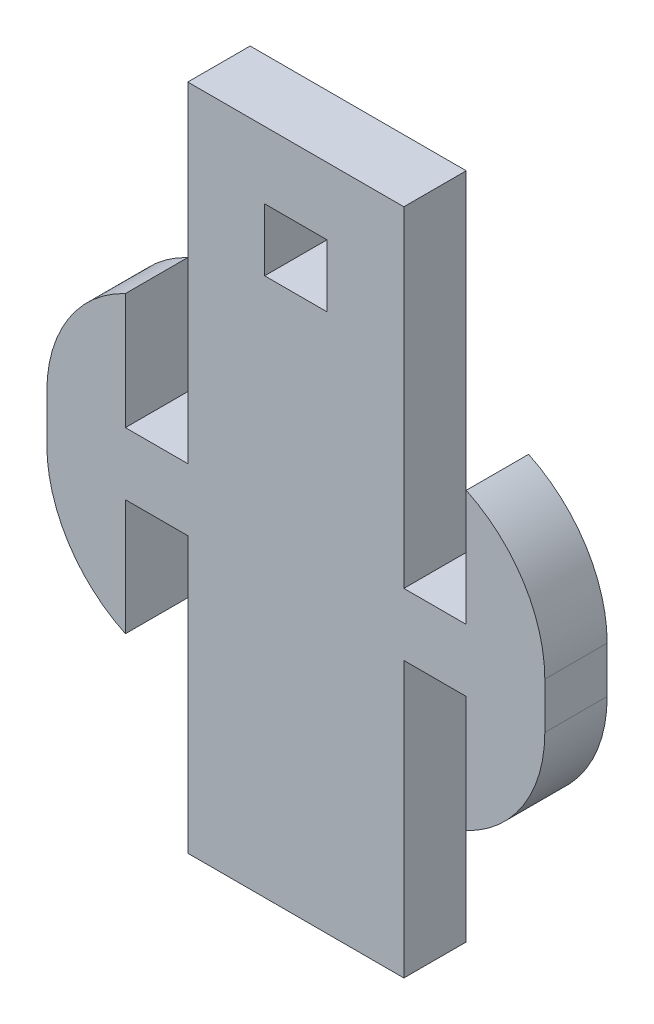
ISO-10303-21;
HEADER;
FILE_DESCRIPTION(('STEP AP214'),'2;1');
FILE_NAME('part.step','',(''),(''),'','','');
FILE_SCHEMA(('AUTOMOTIVE_DESIGN { 1 0 10303 214 1 1 1 1 }'));
ENDSEC;
DATA;
#1=APPLICATION_CONTEXT('core data for automotive mechanical design processes');
#2=APPLICATION_PROTOCOL_DEFINITION('international standard','automotive_design',2000,#1);
#3=PRODUCT_CONTEXT('',#1,'mechanical');
#4=PRODUCT('Part','Part','',(#3));
#5=PRODUCT_RELATED_PRODUCT_CATEGORY('part','',(#4));
#6=PRODUCT_DEFINITION_FORMATION('','',#4);
#7=PRODUCT_DEFINITION_CONTEXT('part definition',#1,'design');
#8=PRODUCT_DEFINITION('design','',#6,#7);
#9=PRODUCT_DEFINITION_SHAPE('','',#8);
#10=(LENGTH_UNIT() NAMED_UNIT(*) SI_UNIT(.MILLI.,.METRE.));
#11=(NAMED_UNIT(*) PLANE_ANGLE_UNIT() SI_UNIT($,.RADIAN.));
#12=(NAMED_UNIT(*) SI_UNIT($,.STERADIAN.) SOLID_ANGLE_UNIT());
#13=UNCERTAINTY_MEASURE_WITH_UNIT(LENGTH_MEASURE(1.E-05),#10,'distance_accuracy_value','');
#14=(GEOMETRIC_REPRESENTATION_CONTEXT(3) GLOBAL_UNCERTAINTY_ASSIGNED_CONTEXT((#13)) GLOBAL_UNIT_ASSIGNED_CONTEXT((#10,
#11,#12)) REPRESENTATION_CONTEXT('',''));
#15=CARTESIAN_POINT('',(0.,0.,0.));
#16=DIRECTION('',(0.,0.,1.));
#17=DIRECTION('',(1.,0.,0.));
#18=AXIS2_PLACEMENT_3D('',#15,#16,#17);
#19=CARTESIAN_POINT('',(3.,45.5623633111909,3.175));
#20=DIRECTION('',(0.,1.,0.));
#21=DIRECTION('',(0.,0.,1.));
#22=AXIS2_PLACEMENT_3D('',#19,#20,#21);
#23=PLANE('',#22);
#24=DIRECTION('',(1.,0.,0.));
#25=VECTOR('',#24,1.);
#26=CARTESIAN_POINT('',(3.,45.5623633111909,0.));
#27=LINE('',#26,#25);
#28=CARTESIAN_POINT('',(-5.5,45.5623633111909,0.));
#29=VERTEX_POINT('',#28);
#30=CARTESIAN_POINT('',(5.5,45.5623633111909,0.));
#31=VERTEX_POINT('',#30);
#32=EDGE_CURVE('E278',#29,#31,#27,.T.);
#33=ORIENTED_EDGE('',*,*,#32,.T.);
#34=DIRECTION('',(0.,0.,-1.));
#35=VECTOR('',#34,1.);
#36=CARTESIAN_POINT('',(5.5,45.5623633111909,3.175));
#37=LINE('',#36,#35);
#38=CARTESIAN_POINT('',(5.5,45.5623633111909,3.175));
#39=VERTEX_POINT('',#38);
#40=EDGE_CURVE('E355',#39,#31,#37,.T.);
#41=ORIENTED_EDGE('',*,*,#40,.F.);
#42=DIRECTION('',(1.,0.,0.));
#43=VECTOR('',#42,1.);
#44=CARTESIAN_POINT('',(-3.,45.5623633111909,3.175));
#45=LINE('',#44,#43);
#46=CARTESIAN_POINT('',(-5.5,45.5623633111909,3.175));
#47=VERTEX_POINT('',#46);
#48=EDGE_CURVE('E285',#47,#39,#45,.T.);
#49=ORIENTED_EDGE('',*,*,#48,.F.);
#50=DIRECTION('',(0.,0.,-1.));
#51=VECTOR('',#50,1.);
#52=CARTESIAN_POINT('',(-5.5,45.5623633111909,3.175));
#53=LINE('',#52,#51);
#54=EDGE_CURVE('E306',#47,#29,#53,.T.);
#55=ORIENTED_EDGE('',*,*,#54,.T.);
#56=EDGE_LOOP('',(#33,#41,#49,#55));
#57=FACE_BOUND('',#56,.T.);
#58=ADVANCED_FACE('F34',(#57),#23,.F.);
#59=CARTESIAN_POINT('',(5.5,59.5623633111909,3.175));
#60=DIRECTION('',(-1.,0.,0.));
#61=DIRECTION('',(0.,-1.,0.));
#62=AXIS2_PLACEMENT_3D('',#59,#60,#61);
#63=PLANE('',#62);
#64=DIRECTION('',(0.,1.,0.));
#65=VECTOR('',#64,1.);
#66=CARTESIAN_POINT('',(5.5,59.5623633111909,0.));
#67=LINE('',#66,#65);
#68=CARTESIAN_POINT('',(5.5,59.5623633111909,0.));
#69=VERTEX_POINT('',#68);
#70=EDGE_CURVE('E308',#31,#69,#67,.T.);
#71=ORIENTED_EDGE('',*,*,#70,.T.);
#72=DIRECTION('',(0.,0.,-1.));
#73=VECTOR('',#72,1.);
#74=CARTESIAN_POINT('',(5.5,59.5623633111909,3.175));
#75=LINE('',#74,#73);
#76=CARTESIAN_POINT('',(5.5,59.5623633111909,3.175));
#77=VERTEX_POINT('',#76);
#78=EDGE_CURVE('E352',#77,#69,#75,.T.);
#79=ORIENTED_EDGE('',*,*,#78,.F.);
#80=DIRECTION('',(0.,1.,0.));
#81=VECTOR('',#80,1.);
#82=CARTESIAN_POINT('',(5.5,59.5623633111909,3.175));
#83=LINE('',#82,#81);
#84=EDGE_CURVE('E287',#39,#77,#83,.T.);
#85=ORIENTED_EDGE('',*,*,#84,.F.);
#86=ORIENTED_EDGE('',*,*,#40,.T.);
#87=EDGE_LOOP('',(#71,#79,#85,#86));
#88=FACE_BOUND('',#87,.T.);
#89=ADVANCED_FACE('F408',(#88),#63,.F.);
#90=CARTESIAN_POINT('',(5.5,59.5623633111909,3.175));
#91=DIRECTION('',(0.,1.,0.));
#92=DIRECTION('',(0.,0.,1.));
#93=AXIS2_PLACEMENT_3D('',#90,#91,#92);
#94=PLANE('',#93);
#95=DIRECTION('',(1.,0.,0.));
#96=VECTOR('',#95,1.);
#97=CARTESIAN_POINT('',(5.5,59.5623633111909,0.));
#98=LINE('',#97,#96);
#99=CARTESIAN_POINT('',(8.675,59.5623633111909,0.));
#100=VERTEX_POINT('',#99);
#101=EDGE_CURVE('E310',#69,#100,#98,.T.);
#102=ORIENTED_EDGE('',*,*,#101,.T.);
#103=DIRECTION('',(0.,0.,-1.));
#104=VECTOR('',#103,1.);
#105=CARTESIAN_POINT('',(8.675,59.5623633111909,3.175));
#106=LINE('',#105,#104);
#107=CARTESIAN_POINT('',(8.675,59.5623633111909,3.175));
#108=VERTEX_POINT('',#107);
#109=EDGE_CURVE('E349',#108,#100,#106,.T.);
#110=ORIENTED_EDGE('',*,*,#109,.F.);
#111=DIRECTION('',(1.,0.,0.));
#112=VECTOR('',#111,1.);
#113=CARTESIAN_POINT('',(5.5,59.5623633111909,3.175));
#114=LINE('',#113,#112);
#115=EDGE_CURVE('E290',#77,#108,#114,.T.);
#116=ORIENTED_EDGE('',*,*,#115,.F.);
#117=ORIENTED_EDGE('',*,*,#78,.T.);
#118=EDGE_LOOP('',(#102,#110,#116,#117));
#119=FACE_BOUND('',#118,.T.);
#120=ADVANCED_FACE('F403',(#119),#94,.F.);
#121=CARTESIAN_POINT('',(8.675,62.7373633111909,3.175));
#122=DIRECTION('',(0.,-1.,0.));
#123=DIRECTION('',(0.,0.,-1.));
#124=AXIS2_PLACEMENT_3D('',#121,#122,#123);
#125=PLANE('',#124);
#126=DIRECTION('',(-1.,0.,0.));
#127=VECTOR('',#126,1.);
#128=CARTESIAN_POINT('',(8.675,62.7373633111909,0.));
#129=LINE('',#128,#127);
#130=CARTESIAN_POINT('',(8.675,62.7373633111909,0.));
#131=VERTEX_POINT('',#130);
#132=CARTESIAN_POINT('',(5.5,62.7373633111909,0.));
#133=VERTEX_POINT('',#132);
#134=EDGE_CURVE('E215',#131,#133,#129,.T.);
#135=ORIENTED_EDGE('',*,*,#134,.T.);
#136=DIRECTION('',(0.,0.,-1.));
#137=VECTOR('',#136,1.);
#138=CARTESIAN_POINT('',(5.5,62.7373633111909,3.175));
#139=LINE('',#138,#137);
#140=CARTESIAN_POINT('',(5.5,62.7373633111909,3.175));
#141=VERTEX_POINT('',#140);
#142=EDGE_CURVE('E344',#141,#133,#139,.T.);
#143=ORIENTED_EDGE('',*,*,#142,.F.);
#144=DIRECTION('',(-1.,0.,0.));
#145=VECTOR('',#144,1.);
#146=CARTESIAN_POINT('',(8.675,62.7373633111909,3.175));
#147=LINE('',#146,#145);
#148=CARTESIAN_POINT('',(8.675,62.7373633111909,3.175));
#149=VERTEX_POINT('',#148);
#150=EDGE_CURVE('E292',#149,#141,#147,.T.);
#151=ORIENTED_EDGE('',*,*,#150,.F.);
#152=DIRECTION('',(0.,0.,-1.));
#153=VECTOR('',#152,1.);
#154=CARTESIAN_POINT('',(8.675,62.7373633111909,3.175));
#155=LINE('',#154,#153);
#156=EDGE_CURVE('E347',#149,#131,#155,.T.);
#157=ORIENTED_EDGE('',*,*,#156,.T.);
#158=EDGE_LOOP('',(#135,#143,#151,#157));
#159=FACE_BOUND('',#158,.T.);
#160=ADVANCED_FACE('F470',(#159),#125,.F.);
#161=CARTESIAN_POINT('',(5.5,79.5623633111909,3.175));
#162=DIRECTION('',(-1.,0.,0.));
#163=DIRECTION('',(0.,-1.,0.));
#164=AXIS2_PLACEMENT_3D('',#161,#162,#163);
#165=PLANE('',#164);
#166=DIRECTION('',(0.,1.,0.));
#167=VECTOR('',#166,1.);
#168=CARTESIAN_POINT('',(5.5,79.5623633111909,0.));
#169=LINE('',#168,#167);
#170=CARTESIAN_POINT('',(5.5,79.5623633111909,0.));
#171=VERTEX_POINT('',#170);
#172=EDGE_CURVE('E313',#133,#171,#169,.T.);
#173=ORIENTED_EDGE('',*,*,#172,.T.);
#174=DIRECTION('',(0.,0.,-1.));
#175=VECTOR('',#174,1.);
#176=CARTESIAN_POINT('',(5.5,79.5623633111909,3.175));
#177=LINE('',#176,#175);
#178=CARTESIAN_POINT('',(5.5,79.5623633111909,3.175));
#179=VERTEX_POINT('',#178);
#180=EDGE_CURVE('E341',#179,#171,#177,.T.);
#181=ORIENTED_EDGE('',*,*,#180,.F.);
#182=DIRECTION('',(0.,1.,0.));
#183=VECTOR('',#182,1.);
#184=CARTESIAN_POINT('',(5.5,79.5623633111909,3.175));
#185=LINE('',#184,#183);
#186=EDGE_CURVE('E294',#141,#179,#185,.T.);
#187=ORIENTED_EDGE('',*,*,#186,.F.);
#188=ORIENTED_EDGE('',*,*,#142,.T.);
#189=EDGE_LOOP('',(#173,#181,#187,#188));
#190=FACE_BOUND('',#189,.T.);
#191=ADVANCED_FACE('F467',(#190),#165,.F.);
#192=CARTESIAN_POINT('',(-5.5,79.5623633111909,3.175));
#193=DIRECTION('',(0.,-1.,0.));
#194=DIRECTION('',(0.,0.,-1.));
#195=AXIS2_PLACEMENT_3D('',#192,#193,#194);
#196=PLANE('',#195);
#197=DIRECTION('',(-1.,0.,0.));
#198=VECTOR('',#197,1.);
#199=CARTESIAN_POINT('',(-5.5,79.5623633111909,0.));
#200=LINE('',#199,#198);
#201=CARTESIAN_POINT('',(-5.5,79.5623633111909,0.));
#202=VERTEX_POINT('',#201);
#203=EDGE_CURVE('E315',#171,#202,#200,.T.);
#204=ORIENTED_EDGE('',*,*,#203,.T.);
#205=DIRECTION('',(0.,0.,-1.));
#206=VECTOR('',#205,1.);
#207=CARTESIAN_POINT('',(-5.5,79.5623633111909,3.175));
#208=LINE('',#207,#206);
#209=CARTESIAN_POINT('',(-5.5,79.5623633111909,3.175));
#210=VERTEX_POINT('',#209);
#211=EDGE_CURVE('E338',#210,#202,#208,.T.);
#212=ORIENTED_EDGE('',*,*,#211,.F.);
#213=DIRECTION('',(-1.,0.,0.));
#214=VECTOR('',#213,1.);
#215=CARTESIAN_POINT('',(-5.5,79.5623633111909,3.175));
#216=LINE('',#215,#214);
#217=EDGE_CURVE('E296',#179,#210,#216,.T.);
#218=ORIENTED_EDGE('',*,*,#217,.F.);
#219=ORIENTED_EDGE('',*,*,#180,.T.);
#220=EDGE_LOOP('',(#204,#212,#218,#219));
#221=FACE_BOUND('',#220,.T.);
#222=ADVANCED_FACE('F463',(#221),#196,.F.);
#223=CARTESIAN_POINT('',(-5.5,79.5623633111909,3.175));
#224=DIRECTION('',(1.,0.,0.));
#225=DIRECTION('',(0.,1.,0.));
#226=AXIS2_PLACEMENT_3D('',#223,#224,#225);
#227=PLANE('',#226);
#228=DIRECTION('',(0.,-1.,0.));
#229=VECTOR('',#228,1.);
#230=CARTESIAN_POINT('',(-5.5,79.5623633111909,0.));
#231=LINE('',#230,#229);
#232=CARTESIAN_POINT('',(-5.5,62.7373633111909,0.));
#233=VERTEX_POINT('',#232);
#234=EDGE_CURVE('E317',#202,#233,#231,.T.);
#235=ORIENTED_EDGE('',*,*,#234,.T.);
#236=DIRECTION('',(0.,0.,-1.));
#237=VECTOR('',#236,1.);
#238=CARTESIAN_POINT('',(-5.5,62.7373633111909,3.175));
#239=LINE('',#238,#237);
#240=CARTESIAN_POINT('',(-5.5,62.7373633111909,3.175));
#241=VERTEX_POINT('',#240);
#242=EDGE_CURVE('E335',#241,#233,#239,.T.);
#243=ORIENTED_EDGE('',*,*,#242,.F.);
#244=DIRECTION('',(0.,-1.,0.));
#245=VECTOR('',#244,1.);
#246=CARTESIAN_POINT('',(-5.5,79.5623633111909,3.175));
#247=LINE('',#246,#245);
#248=EDGE_CURVE('E298',#210,#241,#247,.T.);
#249=ORIENTED_EDGE('',*,*,#248,.F.);
#250=ORIENTED_EDGE('',*,*,#211,.T.);
#251=EDGE_LOOP('',(#235,#243,#249,#250));
#252=FACE_BOUND('',#251,.T.);
#253=ADVANCED_FACE('F458',(#252),#227,.F.);
#254=CARTESIAN_POINT('',(-8.675,62.7373633111909,3.175));
#255=DIRECTION('',(0.,-1.,0.));
#256=DIRECTION('',(0.,0.,-1.));
#257=AXIS2_PLACEMENT_3D('',#254,#255,#256);
#258=PLANE('',#257);
#259=DIRECTION('',(-1.,0.,0.));
#260=VECTOR('',#259,1.);
#261=CARTESIAN_POINT('',(-8.675,62.7373633111909,0.));
#262=LINE('',#261,#260);
#263=CARTESIAN_POINT('',(-8.675,62.7373633111909,0.));
#264=VERTEX_POINT('',#263);
#265=EDGE_CURVE('E319',#233,#264,#262,.T.);
#266=ORIENTED_EDGE('',*,*,#265,.T.);
#267=DIRECTION('',(0.,0.,-1.));
#268=VECTOR('',#267,1.);
#269=CARTESIAN_POINT('',(-8.675,62.7373633111909,3.175));
#270=LINE('',#269,#268);
#271=CARTESIAN_POINT('',(-8.675,62.7373633111909,3.175));
#272=VERTEX_POINT('',#271);
#273=EDGE_CURVE('E332',#272,#264,#270,.T.);
#274=ORIENTED_EDGE('',*,*,#273,.F.);
#275=DIRECTION('',(-1.,0.,0.));
#276=VECTOR('',#275,1.);
#277=CARTESIAN_POINT('',(-8.675,62.7373633111909,3.175));
#278=LINE('',#277,#276);
#279=EDGE_CURVE('E300',#241,#272,#278,.T.);
#280=ORIENTED_EDGE('',*,*,#279,.F.);
#281=ORIENTED_EDGE('',*,*,#242,.T.);
#282=EDGE_LOOP('',(#266,#274,#280,#281));
#283=FACE_BOUND('',#282,.T.);
#284=ADVANCED_FACE('F453',(#283),#258,.F.);
#285=CARTESIAN_POINT('',(-5.5,59.5623633111909,3.175));
#286=DIRECTION('',(0.,1.,0.));
#287=DIRECTION('',(0.,0.,1.));
#288=AXIS2_PLACEMENT_3D('',#285,#286,#287);
#289=PLANE('',#288);
#290=DIRECTION('',(1.,0.,0.));
#291=VECTOR('',#290,1.);
#292=CARTESIAN_POINT('',(-5.5,59.5623633111909,0.));
#293=LINE('',#292,#291);
#294=CARTESIAN_POINT('',(-8.675,59.5623633111909,0.));
#295=VERTEX_POINT('',#294);
#296=CARTESIAN_POINT('',(-5.5,59.5623633111909,0.));
#297=VERTEX_POINT('',#296);
#298=EDGE_CURVE('E321',#295,#297,#293,.T.);
#299=ORIENTED_EDGE('',*,*,#298,.T.);
#300=DIRECTION('',(0.,0.,-1.));
#301=VECTOR('',#300,1.);
#302=CARTESIAN_POINT('',(-5.5,59.5623633111909,3.175));
#303=LINE('',#302,#301);
#304=CARTESIAN_POINT('',(-5.5,59.5623633111909,3.175));
#305=VERTEX_POINT('',#304);
#306=EDGE_CURVE('E327',#305,#297,#303,.T.);
#307=ORIENTED_EDGE('',*,*,#306,.F.);
#308=DIRECTION('',(1.,0.,0.));
#309=VECTOR('',#308,1.);
#310=CARTESIAN_POINT('',(-5.5,59.5623633111909,3.175));
#311=LINE('',#310,#309);
#312=CARTESIAN_POINT('',(-8.675,59.5623633111909,3.175));
#313=VERTEX_POINT('',#312);
#314=EDGE_CURVE('E302',#313,#305,#311,.T.);
#315=ORIENTED_EDGE('',*,*,#314,.F.);
#316=DIRECTION('',(0.,0.,-1.));
#317=VECTOR('',#316,1.);
#318=CARTESIAN_POINT('',(-8.675,59.5623633111909,3.175));
#319=LINE('',#318,#317);
#320=EDGE_CURVE('E330',#313,#295,#319,.T.);
#321=ORIENTED_EDGE('',*,*,#320,.T.);
#322=EDGE_LOOP('',(#299,#307,#315,#321));
#323=FACE_BOUND('',#322,.T.);
#324=ADVANCED_FACE('F418',(#323),#289,.F.);
#325=CARTESIAN_POINT('',(-5.5,59.5623633111909,3.175));
#326=DIRECTION('',(1.,0.,0.));
#327=DIRECTION('',(0.,1.,0.));
#328=AXIS2_PLACEMENT_3D('',#325,#326,#327);
#329=PLANE('',#328);
#330=DIRECTION('',(0.,-1.,0.));
#331=VECTOR('',#330,1.);
#332=CARTESIAN_POINT('',(-5.5,59.5623633111909,0.));
#333=LINE('',#332,#331);
#334=EDGE_CURVE('E288',#297,#29,#333,.T.);
#335=ORIENTED_EDGE('',*,*,#334,.T.);
#336=ORIENTED_EDGE('',*,*,#54,.F.);
#337=DIRECTION('',(0.,-1.,0.));
#338=VECTOR('',#337,1.);
#339=CARTESIAN_POINT('',(-5.5,59.5623633111909,3.175));
#340=LINE('',#339,#338);
#341=EDGE_CURVE('E304',#305,#47,#340,.T.);
#342=ORIENTED_EDGE('',*,*,#341,.F.);
#343=ORIENTED_EDGE('',*,*,#306,.T.);
#344=EDGE_LOOP('',(#335,#336,#342,#343));
#345=FACE_BOUND('',#344,.T.);
#346=ADVANCED_FACE('F414',(#345),#329,.F.);
#347=CARTESIAN_POINT('',(0.,0.,3.175));
#348=DIRECTION('',(0.,0.,1.));
#349=DIRECTION('',(1.,0.,0.));
#350=AXIS2_PLACEMENT_3D('',#347,#348,#349);
#351=PLANE('',#350);
#352=DIRECTION('',(0.,-1.,0.));
#353=VECTOR('',#352,1.);
#354=CARTESIAN_POINT('',(1.5875,72.9748633111909,3.175));
#355=LINE('',#354,#353);
#356=CARTESIAN_POINT('',(1.5875,76.1498633111909,3.175));
#357=VERTEX_POINT('',#356);
#358=CARTESIAN_POINT('',(1.5875,72.9748633111909,3.175));
#359=VERTEX_POINT('',#358);
#360=EDGE_CURVE('E253',#357,#359,#355,.T.);
#361=ORIENTED_EDGE('',*,*,#360,.T.);
#362=DIRECTION('',(-1.,0.,0.));
#363=VECTOR('',#362,1.);
#364=CARTESIAN_POINT('',(-1.5875,72.9748633111909,3.175));
#365=LINE('',#364,#363);
#366=CARTESIAN_POINT('',(-1.5875,72.9748633111909,3.175));
#367=VERTEX_POINT('',#366);
#368=EDGE_CURVE('E256',#359,#367,#365,.T.);
#369=ORIENTED_EDGE('',*,*,#368,.T.);
#370=DIRECTION('',(0.,1.,0.));
#371=VECTOR('',#370,1.);
#372=CARTESIAN_POINT('',(-1.5875,72.9748633111909,3.175));
#373=LINE('',#372,#371);
#374=CARTESIAN_POINT('',(-1.5875,76.1498633111909,3.175));
#375=VERTEX_POINT('',#374);
#376=EDGE_CURVE('E260',#367,#375,#373,.T.);
#377=ORIENTED_EDGE('',*,*,#376,.T.);
#378=DIRECTION('',(1.,0.,0.));
#379=VECTOR('',#378,1.);
#380=CARTESIAN_POINT('',(-1.5875,76.1498633111909,3.175));
#381=LINE('',#380,#379);
#382=EDGE_CURVE('E263',#375,#357,#381,.T.);
#383=ORIENTED_EDGE('',*,*,#382,.T.);
#384=EDGE_LOOP('',(#361,#369,#377,#383));
#385=FACE_BOUND('',#384,.T.);
#386=DIRECTION('',(0.,1.,0.));
#387=VECTOR('',#386,1.);
#388=CARTESIAN_POINT('',(12.675,53.6498633111909,3.175));
#389=LINE('',#388,#387);
#390=CARTESIAN_POINT('',(12.675,59.9744186315276,3.175));
#391=VERTEX_POINT('',#390);
#392=CARTESIAN_POINT('',(12.675,62.3253079908541,3.175));
#393=VERTEX_POINT('',#392);
#394=EDGE_CURVE('E385',#391,#393,#389,.T.);
#395=ORIENTED_EDGE('',*,*,#394,.T.);
#396=CARTESIAN_POINT('',(5.675,62.3253079908541,3.175));
#397=DIRECTION('',(0.,0.,1.));
#398=DIRECTION('',(1.,0.,0.));
#399=AXIS2_PLACEMENT_3D('',#396,#397,#398);
#400=CIRCLE('',#399,7.);
#401=CARTESIAN_POINT('',(8.675,68.6498633111909,3.175));
#402=VERTEX_POINT('',#401);
#403=EDGE_CURVE('E369',#393,#402,#400,.T.);
#404=ORIENTED_EDGE('',*,*,#403,.T.);
#405=DIRECTION('',(0.,1.,0.));
#406=VECTOR('',#405,1.);
#407=CARTESIAN_POINT('',(8.675,53.6498633111909,3.175));
#408=LINE('',#407,#406);
#409=EDGE_CURVE('E223',#149,#402,#408,.T.);
#410=ORIENTED_EDGE('',*,*,#409,.F.);
#411=ORIENTED_EDGE('',*,*,#150,.T.);
#412=ORIENTED_EDGE('',*,*,#186,.T.);
#413=ORIENTED_EDGE('',*,*,#217,.T.);
#414=ORIENTED_EDGE('',*,*,#248,.T.);
#415=ORIENTED_EDGE('',*,*,#279,.T.);
#416=DIRECTION('',(0.,1.,0.));
#417=VECTOR('',#416,1.);
#418=CARTESIAN_POINT('',(-8.675,53.6498633111909,3.175));
#419=LINE('',#418,#417);
#420=CARTESIAN_POINT('',(-8.675,68.6498633111909,3.175));
#421=VERTEX_POINT('',#420);
#422=EDGE_CURVE('E247',#272,#421,#419,.T.);
#423=ORIENTED_EDGE('',*,*,#422,.T.);
#424=CARTESIAN_POINT('',(-5.675,62.3253079908541,3.175));
#425=DIRECTION('',(0.,0.,1.));
#426=DIRECTION('',(1.,0.,0.));
#427=AXIS2_PLACEMENT_3D('',#424,#425,#426);
#428=CIRCLE('',#427,7.);
#429=CARTESIAN_POINT('',(-12.675,62.3253079908541,3.175));
#430=VERTEX_POINT('',#429);
#431=EDGE_CURVE('E49',#421,#430,#428,.T.);
#432=ORIENTED_EDGE('',*,*,#431,.T.);
#433=DIRECTION('',(0.,1.,0.));
#434=VECTOR('',#433,1.);
#435=CARTESIAN_POINT('',(-12.675,53.6498633111909,3.175));
#436=LINE('',#435,#434);
#437=CARTESIAN_POINT('',(-12.675,59.9744186315276,3.175));
#438=VERTEX_POINT('',#437);
#439=EDGE_CURVE('E237',#438,#430,#436,.T.);
#440=ORIENTED_EDGE('',*,*,#439,.F.);
#441=CARTESIAN_POINT('',(-5.675,59.9744186315276,3.175));
#442=DIRECTION('',(0.,0.,1.));
#443=DIRECTION('',(1.,0.,0.));
#444=AXIS2_PLACEMENT_3D('',#441,#442,#443);
#445=CIRCLE('',#444,7.);
#446=CARTESIAN_POINT('',(-8.675,53.6498633111909,3.175));
#447=VERTEX_POINT('',#446);
#448=EDGE_CURVE('E57',#438,#447,#445,.T.);
#449=ORIENTED_EDGE('',*,*,#448,.T.);
#450=EDGE_CURVE('E248',#447,#313,#419,.T.);
#451=ORIENTED_EDGE('',*,*,#450,.T.);
#452=ORIENTED_EDGE('',*,*,#314,.T.);
#453=ORIENTED_EDGE('',*,*,#341,.T.);
#454=ORIENTED_EDGE('',*,*,#48,.T.);
#455=ORIENTED_EDGE('',*,*,#84,.T.);
#456=ORIENTED_EDGE('',*,*,#115,.T.);
#457=CARTESIAN_POINT('',(8.675,53.6498633111909,3.175));
#458=VERTEX_POINT('',#457);
#459=EDGE_CURVE('E225',#458,#108,#408,.T.);
#460=ORIENTED_EDGE('',*,*,#459,.F.);
#461=CARTESIAN_POINT('',(5.675,59.9744186315276,3.175));
#462=DIRECTION('',(0.,0.,1.));
#463=DIRECTION('',(1.,0.,0.));
#464=AXIS2_PLACEMENT_3D('',#461,#462,#463);
#465=CIRCLE('',#464,7.);
#466=EDGE_CURVE('E367',#458,#391,#465,.T.);
#467=ORIENTED_EDGE('',*,*,#466,.T.);
#468=EDGE_LOOP('',(#395,#404,#410,#411,#412,#413,#414,#415,#423,#432,#440,#449,#451,#452,#453,
#454,#455,#456,#460,#467));
#469=FACE_BOUND('',#468,.T.);
#470=ADVANCED_FACE('F376',(#385,#469),#351,.T.);
#471=CARTESIAN_POINT('',(0.,0.,0.));
#472=DIRECTION('',(0.,0.,1.));
#473=DIRECTION('',(1.,0.,0.));
#474=AXIS2_PLACEMENT_3D('',#471,#472,#473);
#475=PLANE('',#474);
#476=DIRECTION('',(-1.,0.,0.));
#477=VECTOR('',#476,1.);
#478=CARTESIAN_POINT('',(-1.5875,72.9748633111909,0.));
#479=LINE('',#478,#477);
#480=CARTESIAN_POINT('',(1.5875,72.9748633111909,0.));
#481=VERTEX_POINT('',#480);
#482=CARTESIAN_POINT('',(-1.5875,72.9748633111909,0.));
#483=VERTEX_POINT('',#482);
#484=EDGE_CURVE('E268',#481,#483,#479,.T.);
#485=ORIENTED_EDGE('',*,*,#484,.F.);
#486=DIRECTION('',(0.,-1.,0.));
#487=VECTOR('',#486,1.);
#488=CARTESIAN_POINT('',(1.5875,72.9748633111909,0.));
#489=LINE('',#488,#487);
#490=CARTESIAN_POINT('',(1.5875,76.1498633111909,0.));
#491=VERTEX_POINT('',#490);
#492=EDGE_CURVE('E240',#491,#481,#489,.T.);
#493=ORIENTED_EDGE('',*,*,#492,.F.);
#494=DIRECTION('',(1.,0.,0.));
#495=VECTOR('',#494,1.);
#496=CARTESIAN_POINT('',(-1.5875,76.1498633111909,0.));
#497=LINE('',#496,#495);
#498=CARTESIAN_POINT('',(-1.5875,76.1498633111909,0.));
#499=VERTEX_POINT('',#498);
#500=EDGE_CURVE('E257',#499,#491,#497,.T.);
#501=ORIENTED_EDGE('',*,*,#500,.F.);
#502=DIRECTION('',(0.,1.,0.));
#503=VECTOR('',#502,1.);
#504=CARTESIAN_POINT('',(-1.5875,72.9748633111909,0.));
#505=LINE('',#504,#503);
#506=EDGE_CURVE('E271',#483,#499,#505,.T.);
#507=ORIENTED_EDGE('',*,*,#506,.F.);
#508=EDGE_LOOP('',(#485,#493,#501,#507));
#509=FACE_BOUND('',#508,.T.);
#510=DIRECTION('',(0.,-1.,0.));
#511=VECTOR('',#510,1.);
#512=CARTESIAN_POINT('',(8.675,53.6498633111909,0.));
#513=LINE('',#512,#511);
#514=CARTESIAN_POINT('',(8.675,68.6498633111909,0.));
#515=VERTEX_POINT('',#514);
#516=EDGE_CURVE('E212',#515,#131,#513,.T.);
#517=ORIENTED_EDGE('',*,*,#516,.F.);
#518=CARTESIAN_POINT('',(5.675,62.3253079908541,0.));
#519=DIRECTION('',(0.,0.,1.));
#520=DIRECTION('',(1.,0.,0.));
#521=AXIS2_PLACEMENT_3D('',#518,#519,#520);
#522=CIRCLE('',#521,7.);
#523=CARTESIAN_POINT('',(12.675,62.3253079908541,0.));
#524=VERTEX_POINT('',#523);
#525=EDGE_CURVE('E197',#515,#524,#522,.F.);
#526=ORIENTED_EDGE('',*,*,#525,.T.);
#527=DIRECTION('',(0.,-1.,0.));
#528=VECTOR('',#527,1.);
#529=CARTESIAN_POINT('',(12.675,53.6498633111909,0.));
#530=LINE('',#529,#528);
#531=CARTESIAN_POINT('',(12.675,59.9744186315276,0.));
#532=VERTEX_POINT('',#531);
#533=EDGE_CURVE('E233',#524,#532,#530,.T.);
#534=ORIENTED_EDGE('',*,*,#533,.T.);
#535=CARTESIAN_POINT('',(5.675,59.9744186315276,0.));
#536=DIRECTION('',(0.,0.,1.));
#537=DIRECTION('',(1.,0.,0.));
#538=AXIS2_PLACEMENT_3D('',#535,#536,#537);
#539=CIRCLE('',#538,7.);
#540=CARTESIAN_POINT('',(8.675,53.6498633111909,0.));
#541=VERTEX_POINT('',#540);
#542=EDGE_CURVE('E208',#532,#541,#539,.F.);
#543=ORIENTED_EDGE('',*,*,#542,.T.);
#544=EDGE_CURVE('E218',#100,#541,#513,.T.);
#545=ORIENTED_EDGE('',*,*,#544,.F.);
#546=ORIENTED_EDGE('',*,*,#101,.F.);
#547=ORIENTED_EDGE('',*,*,#70,.F.);
#548=ORIENTED_EDGE('',*,*,#32,.F.);
#549=ORIENTED_EDGE('',*,*,#334,.F.);
#550=ORIENTED_EDGE('',*,*,#298,.F.);
#551=DIRECTION('',(0.,-1.,0.));
#552=VECTOR('',#551,1.);
#553=CARTESIAN_POINT('',(-8.675,53.6498633111909,0.));
#554=LINE('',#553,#552);
#555=CARTESIAN_POINT('',(-8.675,53.6498633111909,0.));
#556=VERTEX_POINT('',#555);
#557=EDGE_CURVE('E245',#295,#556,#554,.T.);
#558=ORIENTED_EDGE('',*,*,#557,.T.);
#559=CARTESIAN_POINT('',(-5.675,59.9744186315276,0.));
#560=DIRECTION('',(0.,0.,1.));
#561=DIRECTION('',(1.,0.,0.));
#562=AXIS2_PLACEMENT_3D('',#559,#560,#561);
#563=CIRCLE('',#562,7.);
#564=CARTESIAN_POINT('',(-12.675,59.9744186315276,0.));
#565=VERTEX_POINT('',#564);
#566=EDGE_CURVE('E358',#556,#565,#563,.F.);
#567=ORIENTED_EDGE('',*,*,#566,.T.);
#568=DIRECTION('',(0.,-1.,0.));
#569=VECTOR('',#568,1.);
#570=CARTESIAN_POINT('',(-12.675,53.6498633111909,0.));
#571=LINE('',#570,#569);
#572=CARTESIAN_POINT('',(-12.675,62.3253079908541,0.));
#573=VERTEX_POINT('',#572);
#574=EDGE_CURVE('E234',#573,#565,#571,.T.);
#575=ORIENTED_EDGE('',*,*,#574,.F.);
#576=CARTESIAN_POINT('',(-5.675,62.3253079908541,0.));
#577=DIRECTION('',(0.,0.,1.));
#578=DIRECTION('',(1.,0.,0.));
#579=AXIS2_PLACEMENT_3D('',#576,#577,#578);
#580=CIRCLE('',#579,7.);
#581=CARTESIAN_POINT('',(-8.675,68.6498633111909,0.));
#582=VERTEX_POINT('',#581);
#583=EDGE_CURVE('E360',#573,#582,#580,.F.);
#584=ORIENTED_EDGE('',*,*,#583,.T.);
#585=EDGE_CURVE('E241',#582,#264,#554,.T.);
#586=ORIENTED_EDGE('',*,*,#585,.T.);
#587=ORIENTED_EDGE('',*,*,#265,.F.);
#588=ORIENTED_EDGE('',*,*,#234,.F.);
#589=ORIENTED_EDGE('',*,*,#203,.F.);
#590=ORIENTED_EDGE('',*,*,#172,.F.);
#591=ORIENTED_EDGE('',*,*,#134,.F.);
#592=EDGE_LOOP('',(#517,#526,#534,#543,#545,#546,#547,#548,#549,#550,#558,#567,#575,#584,#586,
#587,#588,#589,#590,#591));
#593=FACE_BOUND('',#592,.T.);
#594=ADVANCED_FACE('F213',(#509,#593),#475,.F.);
#595=CARTESIAN_POINT('',(1.5875,72.9748633111909,3.175));
#596=DIRECTION('',(1.,0.,0.));
#597=DIRECTION('',(0.,0.,-1.));
#598=AXIS2_PLACEMENT_3D('',#595,#596,#597);
#599=PLANE('',#598);
#600=ORIENTED_EDGE('',*,*,#492,.T.);
#601=DIRECTION('',(0.,0.,-1.));
#602=VECTOR('',#601,1.);
#603=CARTESIAN_POINT('',(1.5875,72.9748633111909,3.175));
#604=LINE('',#603,#602);
#605=EDGE_CURVE('E266',#359,#481,#604,.T.);
#606=ORIENTED_EDGE('',*,*,#605,.F.);
#607=ORIENTED_EDGE('',*,*,#360,.F.);
#608=DIRECTION('',(0.,0.,-1.));
#609=VECTOR('',#608,1.);
#610=CARTESIAN_POINT('',(1.5875,76.1498633111909,3.175));
#611=LINE('',#610,#609);
#612=EDGE_CURVE('E276',#357,#491,#611,.T.);
#613=ORIENTED_EDGE('',*,*,#612,.T.);
#614=EDGE_LOOP('',(#600,#606,#607,#613));
#615=FACE_BOUND('',#614,.T.);
#616=ADVANCED_FACE('F491',(#615),#599,.F.);
#617=CARTESIAN_POINT('',(-1.5875,76.1498633111909,3.175));
#618=DIRECTION('',(0.,1.,0.));
#619=DIRECTION('',(0.,0.,1.));
#620=AXIS2_PLACEMENT_3D('',#617,#618,#619);
#621=PLANE('',#620);
#622=ORIENTED_EDGE('',*,*,#500,.T.);
#623=ORIENTED_EDGE('',*,*,#612,.F.);
#624=ORIENTED_EDGE('',*,*,#382,.F.);
#625=DIRECTION('',(0.,0.,-1.));
#626=VECTOR('',#625,1.);
#627=CARTESIAN_POINT('',(-1.5875,76.1498633111909,3.175));
#628=LINE('',#627,#626);
#629=EDGE_CURVE('E279',#375,#499,#628,.T.);
#630=ORIENTED_EDGE('',*,*,#629,.T.);
#631=EDGE_LOOP('',(#622,#623,#624,#630));
#632=FACE_BOUND('',#631,.T.);
#633=ADVANCED_FACE('F498',(#632),#621,.F.);
#634=CARTESIAN_POINT('',(-1.5875,72.9748633111909,3.175));
#635=DIRECTION('',(-1.,0.,0.));
#636=DIRECTION('',(0.,0.,1.));
#637=AXIS2_PLACEMENT_3D('',#634,#635,#636);
#638=PLANE('',#637);
#639=ORIENTED_EDGE('',*,*,#506,.T.);
#640=ORIENTED_EDGE('',*,*,#629,.F.);
#641=ORIENTED_EDGE('',*,*,#376,.F.);
#642=DIRECTION('',(0.,0.,-1.));
#643=VECTOR('',#642,1.);
#644=CARTESIAN_POINT('',(-1.5875,72.9748633111909,3.175));
#645=LINE('',#644,#643);
#646=EDGE_CURVE('E281',#367,#483,#645,.T.);
#647=ORIENTED_EDGE('',*,*,#646,.T.);
#648=EDGE_LOOP('',(#639,#640,#641,#647));
#649=FACE_BOUND('',#648,.T.);
#650=ADVANCED_FACE('F503',(#649),#638,.F.);
#651=CARTESIAN_POINT('',(-1.5875,72.9748633111909,3.175));
#652=DIRECTION('',(0.,-1.,0.));
#653=DIRECTION('',(0.,0.,-1.));
#654=AXIS2_PLACEMENT_3D('',#651,#652,#653);
#655=PLANE('',#654);
#656=ORIENTED_EDGE('',*,*,#484,.T.);
#657=ORIENTED_EDGE('',*,*,#646,.F.);
#658=ORIENTED_EDGE('',*,*,#368,.F.);
#659=ORIENTED_EDGE('',*,*,#605,.T.);
#660=EDGE_LOOP('',(#656,#657,#658,#659));
#661=FACE_BOUND('',#660,.T.);
#662=ADVANCED_FACE('F500',(#661),#655,.F.);
#663=CARTESIAN_POINT('',(-8.675,0.,0.));
#664=DIRECTION('',(-1.,0.,0.));
#665=DIRECTION('',(0.,0.,1.));
#666=AXIS2_PLACEMENT_3D('',#663,#664,#665);
#667=PLANE('',#666);
#668=ORIENTED_EDGE('',*,*,#422,.F.);
#669=ORIENTED_EDGE('',*,*,#273,.T.);
#670=ORIENTED_EDGE('',*,*,#585,.F.);
#671=DIRECTION('',(0.,0.,-1.));
#672=VECTOR('',#671,1.);
#673=CARTESIAN_POINT('',(-8.675,68.6498633111909,3.175));
#674=LINE('',#673,#672);
#675=EDGE_CURVE('E238',#421,#582,#674,.T.);
#676=ORIENTED_EDGE('',*,*,#675,.F.);
#677=EDGE_LOOP('',(#668,#669,#670,#676));
#678=FACE_BOUND('',#677,.T.);
#679=ADVANCED_FACE('F449',(#678),#667,.F.);
#680=CARTESIAN_POINT('',(-12.675,0.,0.));
#681=DIRECTION('',(-1.,0.,0.));
#682=DIRECTION('',(0.,0.,1.));
#683=AXIS2_PLACEMENT_3D('',#680,#681,#682);
#684=PLANE('',#683);
#685=ORIENTED_EDGE('',*,*,#439,.T.);
#686=DIRECTION('',(0.,0.,1.));
#687=VECTOR('',#686,1.);
#688=CARTESIAN_POINT('',(-12.675,62.3253079908541,0.));
#689=LINE('',#688,#687);
#690=EDGE_CURVE('E11',#430,#573,#689,.F.);
#691=ORIENTED_EDGE('',*,*,#690,.T.);
#692=ORIENTED_EDGE('',*,*,#574,.T.);
#693=DIRECTION('',(0.,0.,-1.));
#694=VECTOR('',#693,1.);
#695=CARTESIAN_POINT('',(-12.675,59.9744186315276,3.175));
#696=LINE('',#695,#694);
#697=EDGE_CURVE('E42',#565,#438,#696,.F.);
#698=ORIENTED_EDGE('',*,*,#697,.T.);
#699=EDGE_LOOP('',(#685,#691,#692,#698));
#700=FACE_BOUND('',#699,.T.);
#701=ADVANCED_FACE('F371',(#700),#684,.T.);
#702=ORIENTED_EDGE('',*,*,#320,.F.);
#703=ORIENTED_EDGE('',*,*,#450,.F.);
#704=DIRECTION('',(0.,0.,1.));
#705=VECTOR('',#704,1.);
#706=CARTESIAN_POINT('',(-8.675,53.6498633111909,3.175));
#707=LINE('',#706,#705);
#708=EDGE_CURVE('E244',#556,#447,#707,.T.);
#709=ORIENTED_EDGE('',*,*,#708,.F.);
#710=ORIENTED_EDGE('',*,*,#557,.F.);
#711=EDGE_LOOP('',(#702,#703,#709,#710));
#712=FACE_BOUND('',#711,.T.);
#713=ADVANCED_FACE('F381',(#712),#667,.F.);
#714=CARTESIAN_POINT('',(8.675,0.,0.));
#715=DIRECTION('',(1.,0.,0.));
#716=DIRECTION('',(0.,0.,1.));
#717=AXIS2_PLACEMENT_3D('',#714,#715,#716);
#718=PLANE('',#717);
#719=ORIENTED_EDGE('',*,*,#459,.T.);
#720=ORIENTED_EDGE('',*,*,#109,.T.);
#721=ORIENTED_EDGE('',*,*,#544,.T.);
#722=DIRECTION('',(0.,0.,1.));
#723=VECTOR('',#722,1.);
#724=CARTESIAN_POINT('',(8.675,53.6498633111909,3.175));
#725=LINE('',#724,#723);
#726=EDGE_CURVE('E230',#541,#458,#725,.T.);
#727=ORIENTED_EDGE('',*,*,#726,.T.);
#728=EDGE_LOOP('',(#719,#720,#721,#727));
#729=FACE_BOUND('',#728,.T.);
#730=ADVANCED_FACE('F398',(#729),#718,.F.);
#731=CARTESIAN_POINT('',(12.675,0.,0.));
#732=DIRECTION('',(1.,0.,0.));
#733=DIRECTION('',(0.,0.,1.));
#734=AXIS2_PLACEMENT_3D('',#731,#732,#733);
#735=PLANE('',#734);
#736=ORIENTED_EDGE('',*,*,#533,.F.);
#737=DIRECTION('',(0.,0.,1.));
#738=VECTOR('',#737,1.);
#739=CARTESIAN_POINT('',(12.675,62.3253079908541,3.175));
#740=LINE('',#739,#738);
#741=EDGE_CURVE('E203',#524,#393,#740,.T.);
#742=ORIENTED_EDGE('',*,*,#741,.T.);
#743=ORIENTED_EDGE('',*,*,#394,.F.);
#744=DIRECTION('',(0.,0.,-1.));
#745=VECTOR('',#744,1.);
#746=CARTESIAN_POINT('',(12.675,59.9744186315276,0.));
#747=LINE('',#746,#745);
#748=EDGE_CURVE('E207',#391,#532,#747,.T.);
#749=ORIENTED_EDGE('',*,*,#748,.T.);
#750=EDGE_LOOP('',(#736,#742,#743,#749));
#751=FACE_BOUND('',#750,.T.);
#752=ADVANCED_FACE('F419',(#751),#735,.T.);
#753=ORIENTED_EDGE('',*,*,#156,.F.);
#754=ORIENTED_EDGE('',*,*,#409,.T.);
#755=DIRECTION('',(0.,0.,-1.));
#756=VECTOR('',#755,1.);
#757=CARTESIAN_POINT('',(8.675,68.6498633111909,3.175));
#758=LINE('',#757,#756);
#759=EDGE_CURVE('E202',#402,#515,#758,.T.);
#760=ORIENTED_EDGE('',*,*,#759,.T.);
#761=ORIENTED_EDGE('',*,*,#516,.T.);
#762=EDGE_LOOP('',(#753,#754,#760,#761));
#763=FACE_BOUND('',#762,.T.);
#764=ADVANCED_FACE('F221',(#763),#718,.F.);
#765=CARTESIAN_POINT('',(5.675,62.3253079908541,3.175));
#766=DIRECTION('',(0.,0.,-1.));
#767=DIRECTION('',(-1.,0.,0.));
#768=AXIS2_PLACEMENT_3D('',#765,#766,#767);
#769=CYLINDRICAL_SURFACE('',#768,7.);
#770=ORIENTED_EDGE('',*,*,#403,.F.);
#771=ORIENTED_EDGE('',*,*,#741,.F.);
#772=ORIENTED_EDGE('',*,*,#525,.F.);
#773=ORIENTED_EDGE('',*,*,#759,.F.);
#774=EDGE_LOOP('',(#770,#771,#772,#773));
#775=FACE_BOUND('',#774,.T.);
#776=ADVANCED_FACE('F200',(#775),#769,.T.);
#777=CARTESIAN_POINT('',(5.675,59.9744186315276,3.175));
#778=DIRECTION('',(0.,0.,1.));
#779=DIRECTION('',(1.,0.,0.));
#780=AXIS2_PLACEMENT_3D('',#777,#778,#779);
#781=CYLINDRICAL_SURFACE('',#780,7.);
#782=ORIENTED_EDGE('',*,*,#542,.F.);
#783=ORIENTED_EDGE('',*,*,#748,.F.);
#784=ORIENTED_EDGE('',*,*,#466,.F.);
#785=ORIENTED_EDGE('',*,*,#726,.F.);
#786=EDGE_LOOP('',(#782,#783,#784,#785));
#787=FACE_BOUND('',#786,.T.);
#788=ADVANCED_FACE('F395',(#787),#781,.T.);
#789=CARTESIAN_POINT('',(-5.675,62.3253079908541,3.175));
#790=DIRECTION('',(0.,0.,-1.));
#791=DIRECTION('',(-1.,0.,0.));
#792=AXIS2_PLACEMENT_3D('',#789,#790,#791);
#793=CYLINDRICAL_SURFACE('',#792,7.);
#794=ORIENTED_EDGE('',*,*,#431,.F.);
#795=ORIENTED_EDGE('',*,*,#675,.T.);
#796=ORIENTED_EDGE('',*,*,#583,.F.);
#797=ORIENTED_EDGE('',*,*,#690,.F.);
#798=EDGE_LOOP('',(#794,#795,#796,#797));
#799=FACE_BOUND('',#798,.T.);
#800=ADVANCED_FACE('F438',(#799),#793,.T.);
#801=CARTESIAN_POINT('',(-5.675,59.9744186315276,3.175));
#802=DIRECTION('',(0.,0.,1.));
#803=DIRECTION('',(1.,0.,0.));
#804=AXIS2_PLACEMENT_3D('',#801,#802,#803);
#805=CYLINDRICAL_SURFACE('',#804,7.);
#806=ORIENTED_EDGE('',*,*,#566,.F.);
#807=ORIENTED_EDGE('',*,*,#708,.T.);
#808=ORIENTED_EDGE('',*,*,#448,.F.);
#809=ORIENTED_EDGE('',*,*,#697,.F.);
#810=EDGE_LOOP('',(#806,#807,#808,#809));
#811=FACE_BOUND('',#810,.T.);
#812=ADVANCED_FACE('F36',(#811),#805,.T.);
#813=CLOSED_SHELL('',(#58,#89,#120,#160,#191,#222,#253,#284,#324,#346,#470,#594,#616,#633,#650,
#662,#679,#701,#713,#730,#752,#764,#776,#788,#800,#812));
#814=MANIFOLD_SOLID_BREP('B2',#813);
#815=ADVANCED_BREP_SHAPE_REPRESENTATION('',(#18,#814),#14);
#816=SHAPE_DEFINITION_REPRESENTATION(#9,#815);
ENDSEC;
END-ISO-10303-21;
